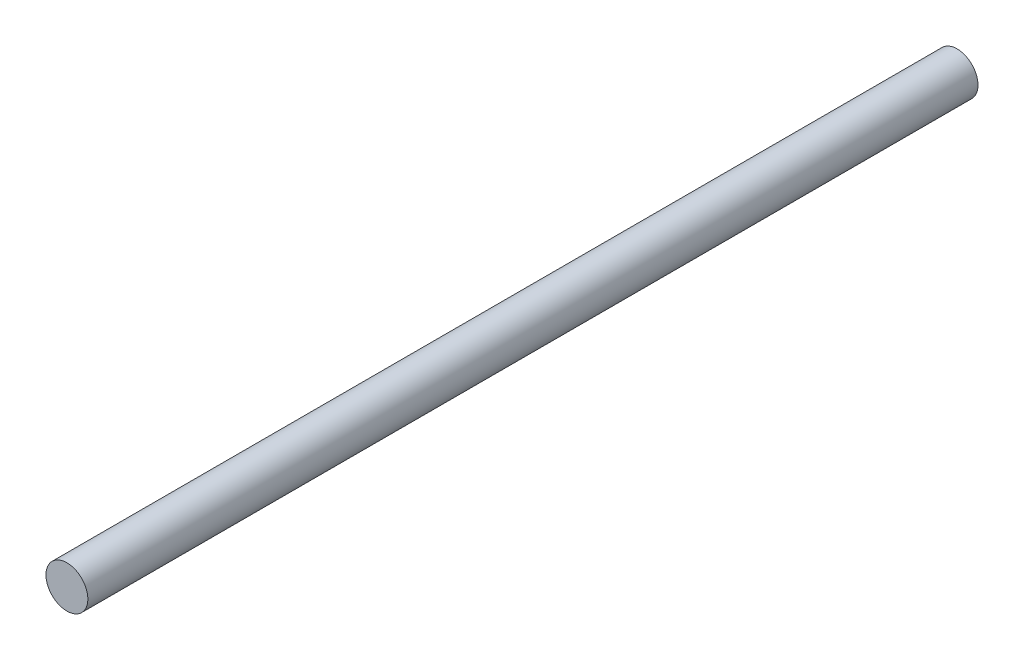
ISO-10303-21;
HEADER;
FILE_DESCRIPTION(('STEP AP214'),'2;1');
FILE_NAME('part.step','',(''),(''),'','','');
FILE_SCHEMA(('AUTOMOTIVE_DESIGN { 1 0 10303 214 1 1 1 1 }'));
ENDSEC;
DATA;
#1=APPLICATION_CONTEXT('core data for automotive mechanical design processes');
#2=APPLICATION_PROTOCOL_DEFINITION('international standard','automotive_design',2000,#1);
#3=PRODUCT_CONTEXT('',#1,'mechanical');
#4=PRODUCT('Part','Part','',(#3));
#5=PRODUCT_RELATED_PRODUCT_CATEGORY('part','',(#4));
#6=PRODUCT_DEFINITION_FORMATION('','',#4);
#7=PRODUCT_DEFINITION_CONTEXT('part definition',#1,'design');
#8=PRODUCT_DEFINITION('design','',#6,#7);
#9=PRODUCT_DEFINITION_SHAPE('','',#8);
#10=(LENGTH_UNIT() NAMED_UNIT(*) SI_UNIT(.MILLI.,.METRE.));
#11=(NAMED_UNIT(*) PLANE_ANGLE_UNIT() SI_UNIT($,.RADIAN.));
#12=(NAMED_UNIT(*) SI_UNIT($,.STERADIAN.) SOLID_ANGLE_UNIT());
#13=UNCERTAINTY_MEASURE_WITH_UNIT(LENGTH_MEASURE(1.E-05),#10,'distance_accuracy_value','');
#14=(GEOMETRIC_REPRESENTATION_CONTEXT(3) GLOBAL_UNCERTAINTY_ASSIGNED_CONTEXT((#13)) GLOBAL_UNIT_ASSIGNED_CONTEXT((#10,
#11,#12)) REPRESENTATION_CONTEXT('',''));
#15=CARTESIAN_POINT('',(0.,0.,0.));
#16=DIRECTION('',(0.,0.,1.));
#17=DIRECTION('',(1.,0.,0.));
#18=AXIS2_PLACEMENT_3D('',#15,#16,#17);
#19=CARTESIAN_POINT('',(0.,0.,85.));
#20=DIRECTION('',(0.,0.,-1.));
#21=DIRECTION('',(-1.,0.,0.));
#22=AXIS2_PLACEMENT_3D('',#19,#20,#21);
#23=CYLINDRICAL_SURFACE('',#22,2.);
#24=CARTESIAN_POINT('',(0.,0.,85.));
#25=DIRECTION('',(0.,0.,1.));
#26=DIRECTION('',(1.,0.,0.));
#27=AXIS2_PLACEMENT_3D('',#24,#25,#26);
#28=CIRCLE('',#27,2.);
#29=CARTESIAN_POINT('',(2.,0.,85.));
#30=VERTEX_POINT('',#29);
#31=EDGE_CURVE('E10',#30,#30,#28,.T.);
#32=ORIENTED_EDGE('',*,*,#31,.F.);
#33=EDGE_LOOP('',(#32));
#34=FACE_BOUND('',#33,.T.);
#35=CARTESIAN_POINT('',(0.,0.,0.));
#36=DIRECTION('',(0.,0.,1.));
#37=DIRECTION('',(1.,0.,0.));
#38=AXIS2_PLACEMENT_3D('',#35,#36,#37);
#39=CIRCLE('',#38,2.);
#40=CARTESIAN_POINT('',(2.,0.,0.));
#41=VERTEX_POINT('',#40);
#42=EDGE_CURVE('E34',#41,#41,#39,.T.);
#43=ORIENTED_EDGE('',*,*,#42,.T.);
#44=EDGE_LOOP('',(#43));
#45=FACE_BOUND('',#44,.T.);
#46=ADVANCED_FACE('F31',(#34,#45),#23,.T.);
#47=CARTESIAN_POINT('',(0.,0.,85.));
#48=DIRECTION('',(0.,0.,1.));
#49=DIRECTION('',(1.,0.,0.));
#50=AXIS2_PLACEMENT_3D('',#47,#48,#49);
#51=PLANE('',#50);
#52=ORIENTED_EDGE('',*,*,#31,.T.);
#53=EDGE_LOOP('',(#52));
#54=FACE_BOUND('',#53,.T.);
#55=ADVANCED_FACE('F46',(#54),#51,.T.);
#56=CARTESIAN_POINT('',(0.,0.,0.));
#57=DIRECTION('',(0.,0.,1.));
#58=DIRECTION('',(1.,0.,0.));
#59=AXIS2_PLACEMENT_3D('',#56,#57,#58);
#60=PLANE('',#59);
#61=ORIENTED_EDGE('',*,*,#42,.F.);
#62=EDGE_LOOP('',(#61));
#63=FACE_BOUND('',#62,.T.);
#64=ADVANCED_FACE('F44',(#63),#60,.F.);
#65=CLOSED_SHELL('',(#46,#55,#64));
#66=MANIFOLD_SOLID_BREP('B2',#65);
#67=ADVANCED_BREP_SHAPE_REPRESENTATION('',(#18,#66),#14);
#68=SHAPE_DEFINITION_REPRESENTATION(#9,#67);
ENDSEC;
END-ISO-10303-21;
